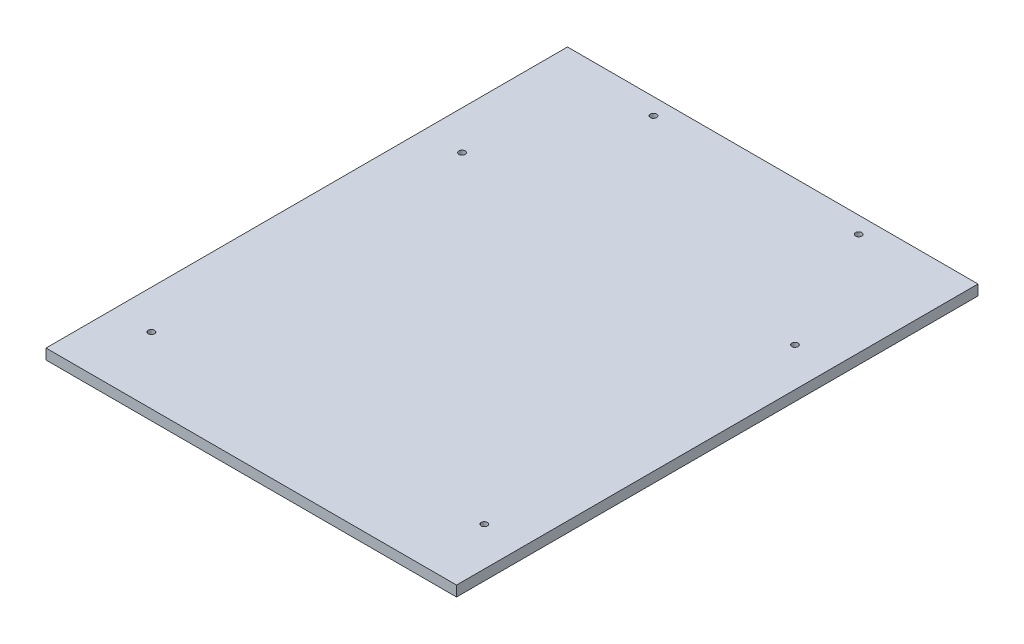
ISO-10303-21;
HEADER;
FILE_DESCRIPTION(('STEP AP214'),'2;1');
FILE_NAME('part.step','',(''),(''),'','','');
FILE_SCHEMA(('AUTOMOTIVE_DESIGN { 1 0 10303 214 1 1 1 1 }'));
ENDSEC;
DATA;
#1=APPLICATION_CONTEXT('core data for automotive mechanical design processes');
#2=APPLICATION_PROTOCOL_DEFINITION('international standard','automotive_design',2000,#1);
#3=PRODUCT_CONTEXT('',#1,'mechanical');
#4=PRODUCT('Part','Part','',(#3));
#5=PRODUCT_RELATED_PRODUCT_CATEGORY('part','',(#4));
#6=PRODUCT_DEFINITION_FORMATION('','',#4);
#7=PRODUCT_DEFINITION_CONTEXT('part definition',#1,'design');
#8=PRODUCT_DEFINITION('design','',#6,#7);
#9=PRODUCT_DEFINITION_SHAPE('','',#8);
#10=(LENGTH_UNIT() NAMED_UNIT(*) SI_UNIT(.MILLI.,.METRE.));
#11=(NAMED_UNIT(*) PLANE_ANGLE_UNIT() SI_UNIT($,.RADIAN.));
#12=(NAMED_UNIT(*) SI_UNIT($,.STERADIAN.) SOLID_ANGLE_UNIT());
#13=UNCERTAINTY_MEASURE_WITH_UNIT(LENGTH_MEASURE(1.E-05),#10,'distance_accuracy_value','');
#14=(GEOMETRIC_REPRESENTATION_CONTEXT(3) GLOBAL_UNCERTAINTY_ASSIGNED_CONTEXT((#13)) GLOBAL_UNIT_ASSIGNED_CONTEXT((#10,
#11,#12)) REPRESENTATION_CONTEXT('',''));
#15=CARTESIAN_POINT('',(0.,0.,0.));
#16=DIRECTION('',(0.,0.,1.));
#17=DIRECTION('',(1.,0.,0.));
#18=AXIS2_PLACEMENT_3D('',#15,#16,#17);
#19=CARTESIAN_POINT('',(0.,0.,0.));
#20=DIRECTION('',(0.,-1.,0.));
#21=DIRECTION('',(0.,0.,-1.));
#22=AXIS2_PLACEMENT_3D('',#19,#20,#21);
#23=PLANE('',#22);
#24=CARTESIAN_POINT('',(-190.5,0.,-133.35));
#25=DIRECTION('',(0.,1.,0.));
#26=DIRECTION('',(0.,0.,1.));
#27=AXIS2_PLACEMENT_3D('',#24,#25,#26);
#28=CIRCLE('',#27,3.571875);
#29=CARTESIAN_POINT('',(-190.5,0.,-129.778125));
#30=VERTEX_POINT('',#29);
#31=EDGE_CURVE('E141',#30,#30,#28,.T.);
#32=ORIENTED_EDGE('',*,*,#31,.T.);
#33=EDGE_LOOP('',(#32));
#34=FACE_BOUND('',#33,.T.);
#35=CARTESIAN_POINT('',(190.5,0.,-133.35));
#36=DIRECTION('',(0.,1.,0.));
#37=DIRECTION('',(0.,0.,1.));
#38=AXIS2_PLACEMENT_3D('',#35,#36,#37);
#39=CIRCLE('',#38,3.571875);
#40=CARTESIAN_POINT('',(190.5,0.,-129.778125));
#41=VERTEX_POINT('',#40);
#42=EDGE_CURVE('E135',#41,#41,#39,.T.);
#43=ORIENTED_EDGE('',*,*,#42,.T.);
#44=EDGE_LOOP('',(#43));
#45=FACE_BOUND('',#44,.T.);
#46=CARTESIAN_POINT('',(190.5,0.,222.25));
#47=DIRECTION('',(0.,1.,0.));
#48=DIRECTION('',(0.,0.,1.));
#49=AXIS2_PLACEMENT_3D('',#46,#47,#48);
#50=CIRCLE('',#49,3.571875);
#51=CARTESIAN_POINT('',(190.5,0.,225.821875));
#52=VERTEX_POINT('',#51);
#53=EDGE_CURVE('E129',#52,#52,#50,.T.);
#54=ORIENTED_EDGE('',*,*,#53,.T.);
#55=EDGE_LOOP('',(#54));
#56=FACE_BOUND('',#55,.T.);
#57=CARTESIAN_POINT('',(117.475,0.,-279.4));
#58=DIRECTION('',(0.,1.,0.));
#59=DIRECTION('',(0.,0.,1.));
#60=AXIS2_PLACEMENT_3D('',#57,#58,#59);
#61=CIRCLE('',#60,3.571875);
#62=CARTESIAN_POINT('',(117.475,0.,-275.828125));
#63=VERTEX_POINT('',#62);
#64=EDGE_CURVE('E101',#63,#63,#61,.T.);
#65=ORIENTED_EDGE('',*,*,#64,.T.);
#66=EDGE_LOOP('',(#65));
#67=FACE_BOUND('',#66,.T.);
#68=DIRECTION('',(0.,0.,-1.));
#69=VECTOR('',#68,1.);
#70=CARTESIAN_POINT('',(234.95,0.,298.45));
#71=LINE('',#70,#69);
#72=CARTESIAN_POINT('',(234.95,0.,298.45));
#73=VERTEX_POINT('',#72);
#74=CARTESIAN_POINT('',(234.95,0.,-298.45));
#75=VERTEX_POINT('',#74);
#76=EDGE_CURVE('E98',#73,#75,#71,.T.);
#77=ORIENTED_EDGE('',*,*,#76,.F.);
#78=DIRECTION('',(1.,0.,0.));
#79=VECTOR('',#78,1.);
#80=CARTESIAN_POINT('',(-234.95,0.,298.45));
#81=LINE('',#80,#79);
#82=CARTESIAN_POINT('',(-234.95,0.,298.45));
#83=VERTEX_POINT('',#82);
#84=EDGE_CURVE('E73',#83,#73,#81,.T.);
#85=ORIENTED_EDGE('',*,*,#84,.F.);
#86=DIRECTION('',(0.,0.,1.));
#87=VECTOR('',#86,1.);
#88=CARTESIAN_POINT('',(-234.95,0.,298.45));
#89=LINE('',#88,#87);
#90=CARTESIAN_POINT('',(-234.95,0.,-298.45));
#91=VERTEX_POINT('',#90);
#92=EDGE_CURVE('E67',#91,#83,#89,.T.);
#93=ORIENTED_EDGE('',*,*,#92,.F.);
#94=DIRECTION('',(-1.,0.,0.));
#95=VECTOR('',#94,1.);
#96=CARTESIAN_POINT('',(-234.95,0.,-298.45));
#97=LINE('',#96,#95);
#98=EDGE_CURVE('E90',#75,#91,#97,.T.);
#99=ORIENTED_EDGE('',*,*,#98,.F.);
#100=EDGE_LOOP('',(#77,#85,#93,#99));
#101=FACE_BOUND('',#100,.T.);
#102=CARTESIAN_POINT('',(-117.475,0.,-279.4));
#103=DIRECTION('',(0.,1.,0.));
#104=DIRECTION('',(0.,0.,1.));
#105=AXIS2_PLACEMENT_3D('',#102,#103,#104);
#106=CIRCLE('',#105,3.571875);
#107=CARTESIAN_POINT('',(-117.475,0.,-275.828125));
#108=VERTEX_POINT('',#107);
#109=EDGE_CURVE('E117',#108,#108,#106,.T.);
#110=ORIENTED_EDGE('',*,*,#109,.T.);
#111=EDGE_LOOP('',(#110));
#112=FACE_BOUND('',#111,.T.);
#113=CARTESIAN_POINT('',(-190.5,0.,222.25));
#114=DIRECTION('',(0.,1.,0.));
#115=DIRECTION('',(0.,0.,1.));
#116=AXIS2_PLACEMENT_3D('',#113,#114,#115);
#117=CIRCLE('',#116,3.571875);
#118=CARTESIAN_POINT('',(-190.5,0.,225.821875));
#119=VERTEX_POINT('',#118);
#120=EDGE_CURVE('E123',#119,#119,#117,.T.);
#121=ORIENTED_EDGE('',*,*,#120,.T.);
#122=EDGE_LOOP('',(#121));
#123=FACE_BOUND('',#122,.T.);
#124=ADVANCED_FACE('F33',(#34,#45,#56,#67,#101,#112,#123),#23,.T.);
#125=CARTESIAN_POINT('',(0.,11.90625,0.));
#126=DIRECTION('',(0.,-1.,0.));
#127=DIRECTION('',(0.,0.,-1.));
#128=AXIS2_PLACEMENT_3D('',#125,#126,#127);
#129=PLANE('',#128);
#130=CARTESIAN_POINT('',(-190.5,11.90625,-133.35));
#131=DIRECTION('',(0.,1.,0.));
#132=DIRECTION('',(0.,0.,1.));
#133=AXIS2_PLACEMENT_3D('',#130,#131,#132);
#134=CIRCLE('',#133,3.571875);
#135=CARTESIAN_POINT('',(-190.5,11.90625,-129.778125));
#136=VERTEX_POINT('',#135);
#137=EDGE_CURVE('E144',#136,#136,#134,.T.);
#138=ORIENTED_EDGE('',*,*,#137,.F.);
#139=EDGE_LOOP('',(#138));
#140=FACE_BOUND('',#139,.T.);
#141=CARTESIAN_POINT('',(190.5,11.90625,-133.35));
#142=DIRECTION('',(0.,1.,0.));
#143=DIRECTION('',(0.,0.,1.));
#144=AXIS2_PLACEMENT_3D('',#141,#142,#143);
#145=CIRCLE('',#144,3.571875);
#146=CARTESIAN_POINT('',(190.5,11.90625,-129.778125));
#147=VERTEX_POINT('',#146);
#148=EDGE_CURVE('E138',#147,#147,#145,.T.);
#149=ORIENTED_EDGE('',*,*,#148,.F.);
#150=EDGE_LOOP('',(#149));
#151=FACE_BOUND('',#150,.T.);
#152=CARTESIAN_POINT('',(190.5,11.90625,222.25));
#153=DIRECTION('',(0.,1.,0.));
#154=DIRECTION('',(0.,0.,1.));
#155=AXIS2_PLACEMENT_3D('',#152,#153,#154);
#156=CIRCLE('',#155,3.571875);
#157=CARTESIAN_POINT('',(190.5,11.90625,225.821875));
#158=VERTEX_POINT('',#157);
#159=EDGE_CURVE('E132',#158,#158,#156,.T.);
#160=ORIENTED_EDGE('',*,*,#159,.F.);
#161=EDGE_LOOP('',(#160));
#162=FACE_BOUND('',#161,.T.);
#163=CARTESIAN_POINT('',(-190.5,11.90625,222.25));
#164=DIRECTION('',(0.,1.,0.));
#165=DIRECTION('',(0.,0.,1.));
#166=AXIS2_PLACEMENT_3D('',#163,#164,#165);
#167=CIRCLE('',#166,3.571875);
#168=CARTESIAN_POINT('',(-190.5,11.90625,225.821875));
#169=VERTEX_POINT('',#168);
#170=EDGE_CURVE('E126',#169,#169,#167,.T.);
#171=ORIENTED_EDGE('',*,*,#170,.F.);
#172=EDGE_LOOP('',(#171));
#173=FACE_BOUND('',#172,.T.);
#174=CARTESIAN_POINT('',(117.475,11.90625,-279.4));
#175=DIRECTION('',(0.,1.,0.));
#176=DIRECTION('',(0.,0.,1.));
#177=AXIS2_PLACEMENT_3D('',#174,#175,#176);
#178=CIRCLE('',#177,3.571875);
#179=CARTESIAN_POINT('',(117.475,11.90625,-275.828125));
#180=VERTEX_POINT('',#179);
#181=EDGE_CURVE('E114',#180,#180,#178,.T.);
#182=ORIENTED_EDGE('',*,*,#181,.F.);
#183=EDGE_LOOP('',(#182));
#184=FACE_BOUND('',#183,.T.);
#185=DIRECTION('',(0.,0.,-1.));
#186=VECTOR('',#185,1.);
#187=CARTESIAN_POINT('',(234.95,11.90625,298.45));
#188=LINE('',#187,#186);
#189=CARTESIAN_POINT('',(234.95,11.90625,298.45));
#190=VERTEX_POINT('',#189);
#191=CARTESIAN_POINT('',(234.95,11.90625,-298.45));
#192=VERTEX_POINT('',#191);
#193=EDGE_CURVE('E86',#190,#192,#188,.T.);
#194=ORIENTED_EDGE('',*,*,#193,.T.);
#195=DIRECTION('',(-1.,0.,0.));
#196=VECTOR('',#195,1.);
#197=CARTESIAN_POINT('',(-234.95,11.90625,-298.45));
#198=LINE('',#197,#196);
#199=CARTESIAN_POINT('',(-234.95,11.90625,-298.45));
#200=VERTEX_POINT('',#199);
#201=EDGE_CURVE('E80',#192,#200,#198,.T.);
#202=ORIENTED_EDGE('',*,*,#201,.T.);
#203=DIRECTION('',(0.,0.,1.));
#204=VECTOR('',#203,1.);
#205=CARTESIAN_POINT('',(-234.95,11.90625,298.45));
#206=LINE('',#205,#204);
#207=CARTESIAN_POINT('',(-234.95,11.90625,298.45));
#208=VERTEX_POINT('',#207);
#209=EDGE_CURVE('E84',#200,#208,#206,.T.);
#210=ORIENTED_EDGE('',*,*,#209,.T.);
#211=DIRECTION('',(1.,0.,0.));
#212=VECTOR('',#211,1.);
#213=CARTESIAN_POINT('',(-234.95,11.90625,298.45));
#214=LINE('',#213,#212);
#215=EDGE_CURVE('E50',#208,#190,#214,.T.);
#216=ORIENTED_EDGE('',*,*,#215,.T.);
#217=EDGE_LOOP('',(#194,#202,#210,#216));
#218=FACE_BOUND('',#217,.T.);
#219=CARTESIAN_POINT('',(-117.475,11.90625,-279.4));
#220=DIRECTION('',(0.,1.,0.));
#221=DIRECTION('',(0.,0.,1.));
#222=AXIS2_PLACEMENT_3D('',#219,#220,#221);
#223=CIRCLE('',#222,3.571875);
#224=CARTESIAN_POINT('',(-117.475,11.90625,-275.828125));
#225=VERTEX_POINT('',#224);
#226=EDGE_CURVE('E120',#225,#225,#223,.T.);
#227=ORIENTED_EDGE('',*,*,#226,.F.);
#228=EDGE_LOOP('',(#227));
#229=FACE_BOUND('',#228,.T.);
#230=ADVANCED_FACE('F81',(#140,#151,#162,#173,#184,#218,#229),#129,.F.);
#231=CARTESIAN_POINT('',(234.95,11.90625,298.45));
#232=DIRECTION('',(-1.,0.,0.));
#233=DIRECTION('',(0.,0.,1.));
#234=AXIS2_PLACEMENT_3D('',#231,#232,#233);
#235=PLANE('',#234);
#236=ORIENTED_EDGE('',*,*,#76,.T.);
#237=DIRECTION('',(0.,-1.,0.));
#238=VECTOR('',#237,1.);
#239=CARTESIAN_POINT('',(234.95,11.90625,-298.45));
#240=LINE('',#239,#238);
#241=EDGE_CURVE('E11',#192,#75,#240,.T.);
#242=ORIENTED_EDGE('',*,*,#241,.F.);
#243=ORIENTED_EDGE('',*,*,#193,.F.);
#244=DIRECTION('',(0.,-1.,0.));
#245=VECTOR('',#244,1.);
#246=CARTESIAN_POINT('',(234.95,11.90625,298.45));
#247=LINE('',#246,#245);
#248=EDGE_CURVE('E94',#190,#73,#247,.T.);
#249=ORIENTED_EDGE('',*,*,#248,.T.);
#250=EDGE_LOOP('',(#236,#242,#243,#249));
#251=FACE_BOUND('',#250,.T.);
#252=ADVANCED_FACE('F35',(#251),#235,.F.);
#253=CARTESIAN_POINT('',(-234.95,11.90625,-298.45));
#254=DIRECTION('',(0.,0.,1.));
#255=DIRECTION('',(1.,0.,0.));
#256=AXIS2_PLACEMENT_3D('',#253,#254,#255);
#257=PLANE('',#256);
#258=ORIENTED_EDGE('',*,*,#98,.T.);
#259=DIRECTION('',(0.,-1.,0.));
#260=VECTOR('',#259,1.);
#261=CARTESIAN_POINT('',(-234.95,11.90625,-298.45));
#262=LINE('',#261,#260);
#263=EDGE_CURVE('E42',#200,#91,#262,.T.);
#264=ORIENTED_EDGE('',*,*,#263,.F.);
#265=ORIENTED_EDGE('',*,*,#201,.F.);
#266=ORIENTED_EDGE('',*,*,#241,.T.);
#267=EDGE_LOOP('',(#258,#264,#265,#266));
#268=FACE_BOUND('',#267,.T.);
#269=ADVANCED_FACE('F89',(#268),#257,.F.);
#270=CARTESIAN_POINT('',(-234.95,11.90625,298.45));
#271=DIRECTION('',(1.,0.,0.));
#272=DIRECTION('',(0.,0.,-1.));
#273=AXIS2_PLACEMENT_3D('',#270,#271,#272);
#274=PLANE('',#273);
#275=ORIENTED_EDGE('',*,*,#92,.T.);
#276=DIRECTION('',(0.,-1.,0.));
#277=VECTOR('',#276,1.);
#278=CARTESIAN_POINT('',(-234.95,11.90625,298.45));
#279=LINE('',#278,#277);
#280=EDGE_CURVE('E91',#208,#83,#279,.T.);
#281=ORIENTED_EDGE('',*,*,#280,.F.);
#282=ORIENTED_EDGE('',*,*,#209,.F.);
#283=ORIENTED_EDGE('',*,*,#263,.T.);
#284=EDGE_LOOP('',(#275,#281,#282,#283));
#285=FACE_BOUND('',#284,.T.);
#286=ADVANCED_FACE('F92',(#285),#274,.F.);
#287=CARTESIAN_POINT('',(-234.95,11.90625,298.45));
#288=DIRECTION('',(0.,0.,-1.));
#289=DIRECTION('',(-1.,0.,0.));
#290=AXIS2_PLACEMENT_3D('',#287,#288,#289);
#291=PLANE('',#290);
#292=ORIENTED_EDGE('',*,*,#84,.T.);
#293=ORIENTED_EDGE('',*,*,#248,.F.);
#294=ORIENTED_EDGE('',*,*,#215,.F.);
#295=ORIENTED_EDGE('',*,*,#280,.T.);
#296=EDGE_LOOP('',(#292,#293,#294,#295));
#297=FACE_BOUND('',#296,.T.);
#298=ADVANCED_FACE('F106',(#297),#291,.F.);
#299=CARTESIAN_POINT('',(117.475,11.90625,-279.4));
#300=DIRECTION('',(0.,1.,0.));
#301=DIRECTION('',(0.,0.,1.));
#302=AXIS2_PLACEMENT_3D('',#299,#300,#301);
#303=CYLINDRICAL_SURFACE('',#302,3.571875);
#304=ORIENTED_EDGE('',*,*,#64,.F.);
#305=EDGE_LOOP('',(#304));
#306=FACE_BOUND('',#305,.T.);
#307=ORIENTED_EDGE('',*,*,#181,.T.);
#308=EDGE_LOOP('',(#307));
#309=FACE_BOUND('',#308,.T.);
#310=ADVANCED_FACE('F161',(#306,#309),#303,.F.);
#311=CARTESIAN_POINT('',(-117.475,11.90625,-279.4));
#312=DIRECTION('',(0.,1.,0.));
#313=DIRECTION('',(0.,0.,1.));
#314=AXIS2_PLACEMENT_3D('',#311,#312,#313);
#315=CYLINDRICAL_SURFACE('',#314,3.571875);
#316=ORIENTED_EDGE('',*,*,#109,.F.);
#317=EDGE_LOOP('',(#316));
#318=FACE_BOUND('',#317,.T.);
#319=ORIENTED_EDGE('',*,*,#226,.T.);
#320=EDGE_LOOP('',(#319));
#321=FACE_BOUND('',#320,.T.);
#322=ADVANCED_FACE('F163',(#318,#321),#315,.F.);
#323=CARTESIAN_POINT('',(-190.5,11.90625,222.25));
#324=DIRECTION('',(0.,1.,0.));
#325=DIRECTION('',(0.,0.,1.));
#326=AXIS2_PLACEMENT_3D('',#323,#324,#325);
#327=CYLINDRICAL_SURFACE('',#326,3.571875);
#328=ORIENTED_EDGE('',*,*,#120,.F.);
#329=EDGE_LOOP('',(#328));
#330=FACE_BOUND('',#329,.T.);
#331=ORIENTED_EDGE('',*,*,#170,.T.);
#332=EDGE_LOOP('',(#331));
#333=FACE_BOUND('',#332,.T.);
#334=ADVANCED_FACE('F170',(#330,#333),#327,.F.);
#335=CARTESIAN_POINT('',(190.5,11.90625,222.25));
#336=DIRECTION('',(0.,1.,0.));
#337=DIRECTION('',(0.,0.,1.));
#338=AXIS2_PLACEMENT_3D('',#335,#336,#337);
#339=CYLINDRICAL_SURFACE('',#338,3.571875);
#340=ORIENTED_EDGE('',*,*,#53,.F.);
#341=EDGE_LOOP('',(#340));
#342=FACE_BOUND('',#341,.T.);
#343=ORIENTED_EDGE('',*,*,#159,.T.);
#344=EDGE_LOOP('',(#343));
#345=FACE_BOUND('',#344,.T.);
#346=ADVANCED_FACE('F216',(#342,#345),#339,.F.);
#347=CARTESIAN_POINT('',(190.5,11.90625,-133.35));
#348=DIRECTION('',(0.,1.,0.));
#349=DIRECTION('',(0.,0.,1.));
#350=AXIS2_PLACEMENT_3D('',#347,#348,#349);
#351=CYLINDRICAL_SURFACE('',#350,3.571875);
#352=ORIENTED_EDGE('',*,*,#42,.F.);
#353=EDGE_LOOP('',(#352));
#354=FACE_BOUND('',#353,.T.);
#355=ORIENTED_EDGE('',*,*,#148,.T.);
#356=EDGE_LOOP('',(#355));
#357=FACE_BOUND('',#356,.T.);
#358=ADVANCED_FACE('F226',(#354,#357),#351,.F.);
#359=CARTESIAN_POINT('',(-190.5,11.90625,-133.35));
#360=DIRECTION('',(0.,1.,0.));
#361=DIRECTION('',(0.,0.,1.));
#362=AXIS2_PLACEMENT_3D('',#359,#360,#361);
#363=CYLINDRICAL_SURFACE('',#362,3.571875);
#364=ORIENTED_EDGE('',*,*,#31,.F.);
#365=EDGE_LOOP('',(#364));
#366=FACE_BOUND('',#365,.T.);
#367=ORIENTED_EDGE('',*,*,#137,.T.);
#368=EDGE_LOOP('',(#367));
#369=FACE_BOUND('',#368,.T.);
#370=ADVANCED_FACE('F148',(#366,#369),#363,.F.);
#371=CLOSED_SHELL('',(#124,#230,#252,#269,#286,#298,#310,#322,#334,#346,#358,#370));
#372=MANIFOLD_SOLID_BREP('B2',#371);
#373=ADVANCED_BREP_SHAPE_REPRESENTATION('',(#18,#372),#14);
#374=SHAPE_DEFINITION_REPRESENTATION(#9,#373);
ENDSEC;
END-ISO-10303-21;
